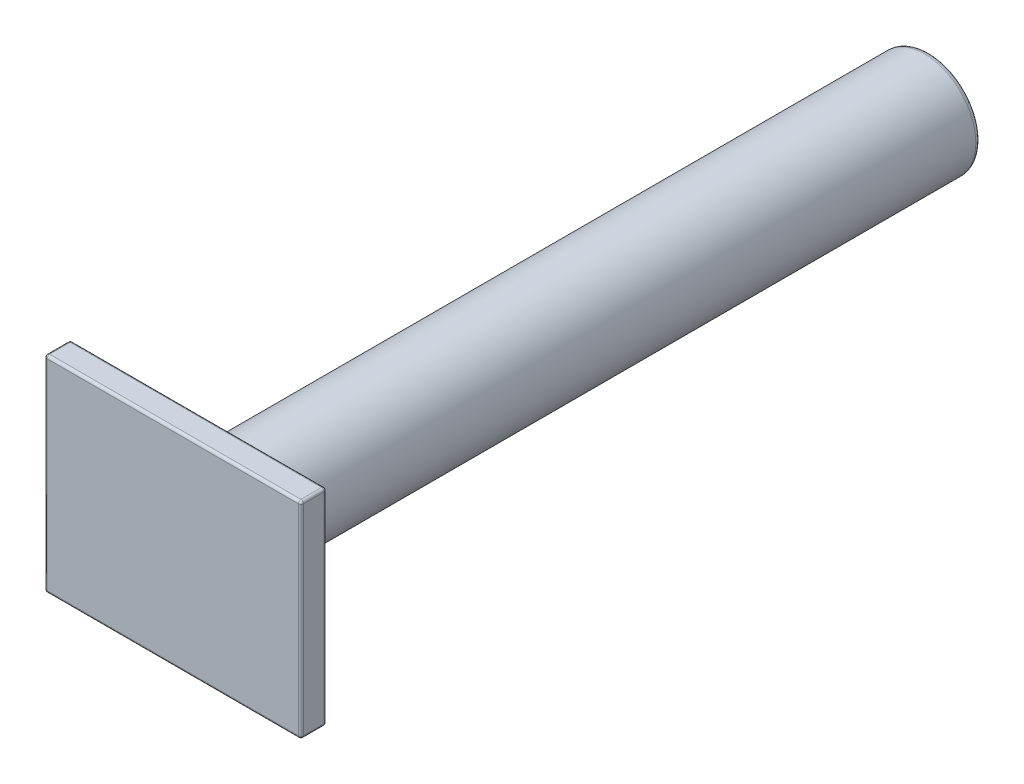
ISO-10303-21;
HEADER;
FILE_DESCRIPTION(('STEP AP214'),'2;1');
FILE_NAME('part.step','',(''),(''),'','','');
FILE_SCHEMA(('AUTOMOTIVE_DESIGN { 1 0 10303 214 1 1 1 1 }'));
ENDSEC;
DATA;
#1=APPLICATION_CONTEXT('core data for automotive mechanical design processes');
#2=APPLICATION_PROTOCOL_DEFINITION('international standard','automotive_design',2000,#1);
#3=PRODUCT_CONTEXT('',#1,'mechanical');
#4=PRODUCT('Part','Part','',(#3));
#5=PRODUCT_RELATED_PRODUCT_CATEGORY('part','',(#4));
#6=PRODUCT_DEFINITION_FORMATION('','',#4);
#7=PRODUCT_DEFINITION_CONTEXT('part definition',#1,'design');
#8=PRODUCT_DEFINITION('design','',#6,#7);
#9=PRODUCT_DEFINITION_SHAPE('','',#8);
#10=(LENGTH_UNIT() NAMED_UNIT(*) SI_UNIT(.MILLI.,.METRE.));
#11=(NAMED_UNIT(*) PLANE_ANGLE_UNIT() SI_UNIT($,.RADIAN.));
#12=(NAMED_UNIT(*) SI_UNIT($,.STERADIAN.) SOLID_ANGLE_UNIT());
#13=UNCERTAINTY_MEASURE_WITH_UNIT(LENGTH_MEASURE(1.E-05),#10,'distance_accuracy_value','');
#14=(GEOMETRIC_REPRESENTATION_CONTEXT(3) GLOBAL_UNCERTAINTY_ASSIGNED_CONTEXT((#13)) GLOBAL_UNIT_ASSIGNED_CONTEXT((#10,
#11,#12)) REPRESENTATION_CONTEXT('',''));
#15=CARTESIAN_POINT('',(0.,0.,0.));
#16=DIRECTION('',(0.,0.,1.));
#17=DIRECTION('',(1.,0.,0.));
#18=AXIS2_PLACEMENT_3D('',#15,#16,#17);
#19=CARTESIAN_POINT('',(0.,0.,284.));
#20=DIRECTION('',(0.,0.,-1.));
#21=DIRECTION('',(-1.,0.,0.));
#22=AXIS2_PLACEMENT_3D('',#19,#20,#21);
#23=CYLINDRICAL_SURFACE('',#22,20.);
#24=CARTESIAN_POINT('',(0.,0.,2.));
#25=DIRECTION('',(0.,0.,1.));
#26=DIRECTION('',(1.,0.,0.));
#27=AXIS2_PLACEMENT_3D('',#24,#25,#26);
#28=CIRCLE('',#27,20.);
#29=CARTESIAN_POINT('',(20.,0.,2.));
#30=VERTEX_POINT('',#29);
#31=EDGE_CURVE('E178',#30,#30,#28,.T.);
#32=ORIENTED_EDGE('',*,*,#31,.T.);
#33=EDGE_LOOP('',(#32));
#34=FACE_BOUND('',#33,.T.);
#35=CARTESIAN_POINT('',(0.,0.,284.));
#36=DIRECTION('',(0.,0.,1.));
#37=DIRECTION('',(1.,0.,0.));
#38=AXIS2_PLACEMENT_3D('',#35,#36,#37);
#39=CIRCLE('',#38,20.);
#40=CARTESIAN_POINT('',(20.,0.,284.));
#41=VERTEX_POINT('',#40);
#42=EDGE_CURVE('E316',#41,#41,#39,.T.);
#43=ORIENTED_EDGE('',*,*,#42,.F.);
#44=EDGE_LOOP('',(#43));
#45=FACE_BOUND('',#44,.T.);
#46=ADVANCED_FACE('F39',(#34,#45),#23,.T.);
#47=CARTESIAN_POINT('',(0.,0.,0.));
#48=DIRECTION('',(0.,0.,1.));
#49=DIRECTION('',(1.,0.,0.));
#50=AXIS2_PLACEMENT_3D('',#47,#48,#49);
#51=PLANE('',#50);
#52=CARTESIAN_POINT('',(0.,0.,0.));
#53=DIRECTION('',(0.,0.,1.));
#54=DIRECTION('',(1.,0.,0.));
#55=AXIS2_PLACEMENT_3D('',#52,#53,#54);
#56=CIRCLE('',#55,18.);
#57=CARTESIAN_POINT('',(18.,0.,0.));
#58=VERTEX_POINT('',#57);
#59=EDGE_CURVE('E174',#58,#58,#56,.F.);
#60=ORIENTED_EDGE('',*,*,#59,.T.);
#61=EDGE_LOOP('',(#60));
#62=FACE_BOUND('',#61,.T.);
#63=ADVANCED_FACE('F350',(#62),#51,.F.);
#64=CARTESIAN_POINT('',(49.8054474708182,40.,294.));
#65=DIRECTION('',(-1.,0.,0.));
#66=DIRECTION('',(0.,0.,1.));
#67=AXIS2_PLACEMENT_3D('',#64,#65,#66);
#68=PLANE('',#67);
#69=DIRECTION('',(0.,1.,0.));
#70=VECTOR('',#69,1.);
#71=CARTESIAN_POINT('',(49.8054474708182,40.,285.));
#72=LINE('',#71,#70);
#73=CARTESIAN_POINT('',(49.8054474708182,-39.,285.));
#74=VERTEX_POINT('',#73);
#75=CARTESIAN_POINT('',(49.8054474708182,39.,285.));
#76=VERTEX_POINT('',#75);
#77=EDGE_CURVE('E186',#74,#76,#72,.T.);
#78=ORIENTED_EDGE('',*,*,#77,.T.);
#79=DIRECTION('',(0.,0.,-1.));
#80=VECTOR('',#79,1.);
#81=CARTESIAN_POINT('',(49.8054474708182,39.,294.));
#82=LINE('',#81,#80);
#83=CARTESIAN_POINT('',(49.8054474708182,39.,293.));
#84=VERTEX_POINT('',#83);
#85=EDGE_CURVE('E195',#76,#84,#82,.F.);
#86=ORIENTED_EDGE('',*,*,#85,.T.);
#87=DIRECTION('',(0.,1.,0.));
#88=VECTOR('',#87,1.);
#89=CARTESIAN_POINT('',(49.8054474708182,-40.,293.));
#90=LINE('',#89,#88);
#91=CARTESIAN_POINT('',(49.8054474708182,-39.,293.));
#92=VERTEX_POINT('',#91);
#93=EDGE_CURVE('E192',#84,#92,#90,.F.);
#94=ORIENTED_EDGE('',*,*,#93,.T.);
#95=DIRECTION('',(0.,0.,-1.));
#96=VECTOR('',#95,1.);
#97=CARTESIAN_POINT('',(49.8054474708182,-39.,294.));
#98=LINE('',#97,#96);
#99=EDGE_CURVE('E189',#92,#74,#98,.T.);
#100=ORIENTED_EDGE('',*,*,#99,.T.);
#101=EDGE_LOOP('',(#78,#86,#94,#100));
#102=FACE_BOUND('',#101,.T.);
#103=ADVANCED_FACE('F354',(#102),#68,.F.);
#104=CARTESIAN_POINT('',(-49.8054474708183,40.,294.));
#105=DIRECTION('',(0.,-1.,0.));
#106=DIRECTION('',(1.,0.,0.));
#107=AXIS2_PLACEMENT_3D('',#104,#105,#106);
#108=PLANE('',#107);
#109=DIRECTION('',(0.,0.,-1.));
#110=VECTOR('',#109,1.);
#111=CARTESIAN_POINT('',(48.8054474708182,40.,294.));
#112=LINE('',#111,#110);
#113=CARTESIAN_POINT('',(48.8054474708182,40.,293.));
#114=VERTEX_POINT('',#113);
#115=CARTESIAN_POINT('',(48.8054474708182,40.,285.));
#116=VERTEX_POINT('',#115);
#117=EDGE_CURVE('E144',#114,#116,#112,.T.);
#118=ORIENTED_EDGE('',*,*,#117,.T.);
#119=DIRECTION('',(-1.,0.,0.));
#120=VECTOR('',#119,1.);
#121=CARTESIAN_POINT('',(-49.8054474708183,40.,285.));
#122=LINE('',#121,#120);
#123=CARTESIAN_POINT('',(-48.8054474708183,40.,285.));
#124=VERTEX_POINT('',#123);
#125=EDGE_CURVE('E139',#116,#124,#122,.T.);
#126=ORIENTED_EDGE('',*,*,#125,.T.);
#127=DIRECTION('',(0.,0.,-1.));
#128=VECTOR('',#127,1.);
#129=CARTESIAN_POINT('',(-48.8054474708183,40.,294.));
#130=LINE('',#129,#128);
#131=CARTESIAN_POINT('',(-48.8054474708183,40.,293.));
#132=VERTEX_POINT('',#131);
#133=EDGE_CURVE('E131',#124,#132,#130,.F.);
#134=ORIENTED_EDGE('',*,*,#133,.T.);
#135=DIRECTION('',(-1.,0.,0.));
#136=VECTOR('',#135,1.);
#137=CARTESIAN_POINT('',(49.8054474708182,40.,293.));
#138=LINE('',#137,#136);
#139=EDGE_CURVE('E136',#132,#114,#138,.F.);
#140=ORIENTED_EDGE('',*,*,#139,.T.);
#141=EDGE_LOOP('',(#118,#126,#134,#140));
#142=FACE_BOUND('',#141,.T.);
#143=ADVANCED_FACE('F134',(#142),#108,.F.);
#144=CARTESIAN_POINT('',(-49.8054474708183,40.,294.));
#145=DIRECTION('',(1.,0.,0.));
#146=DIRECTION('',(0.,1.,0.));
#147=AXIS2_PLACEMENT_3D('',#144,#145,#146);
#148=PLANE('',#147);
#149=DIRECTION('',(0.,-1.,0.));
#150=VECTOR('',#149,1.);
#151=CARTESIAN_POINT('',(-49.8054474708183,40.,293.));
#152=LINE('',#151,#150);
#153=CARTESIAN_POINT('',(-49.8054474708182,-39.,293.));
#154=VERTEX_POINT('',#153);
#155=CARTESIAN_POINT('',(-49.8054474708183,39.,293.));
#156=VERTEX_POINT('',#155);
#157=EDGE_CURVE('E205',#154,#156,#152,.F.);
#158=ORIENTED_EDGE('',*,*,#157,.T.);
#159=DIRECTION('',(0.,0.,-1.));
#160=VECTOR('',#159,1.);
#161=CARTESIAN_POINT('',(-49.8054474708183,39.,294.));
#162=LINE('',#161,#160);
#163=CARTESIAN_POINT('',(-49.8054474708183,39.,285.));
#164=VERTEX_POINT('',#163);
#165=EDGE_CURVE('E152',#156,#164,#162,.T.);
#166=ORIENTED_EDGE('',*,*,#165,.T.);
#167=DIRECTION('',(0.,-1.,0.));
#168=VECTOR('',#167,1.);
#169=CARTESIAN_POINT('',(-49.8054474708183,40.,285.));
#170=LINE('',#169,#168);
#171=CARTESIAN_POINT('',(-49.8054474708182,-39.,285.));
#172=VERTEX_POINT('',#171);
#173=EDGE_CURVE('E199',#164,#172,#170,.T.);
#174=ORIENTED_EDGE('',*,*,#173,.T.);
#175=DIRECTION('',(0.,0.,-1.));
#176=VECTOR('',#175,1.);
#177=CARTESIAN_POINT('',(-49.8054474708182,-39.,294.));
#178=LINE('',#177,#176);
#179=EDGE_CURVE('E202',#172,#154,#178,.F.);
#180=ORIENTED_EDGE('',*,*,#179,.T.);
#181=EDGE_LOOP('',(#158,#166,#174,#180));
#182=FACE_BOUND('',#181,.T.);
#183=ADVANCED_FACE('F363',(#182),#148,.F.);
#184=CARTESIAN_POINT('',(-49.8054474708182,-40.,294.));
#185=DIRECTION('',(0.,1.,0.));
#186=DIRECTION('',(-1.,0.,0.));
#187=AXIS2_PLACEMENT_3D('',#184,#185,#186);
#188=PLANE('',#187);
#189=DIRECTION('',(0.,0.,-1.));
#190=VECTOR('',#189,1.);
#191=CARTESIAN_POINT('',(48.8054474708182,-40.,294.));
#192=LINE('',#191,#190);
#193=CARTESIAN_POINT('',(48.8054474708182,-40.,285.));
#194=VERTEX_POINT('',#193);
#195=CARTESIAN_POINT('',(48.8054474708182,-40.,293.));
#196=VERTEX_POINT('',#195);
#197=EDGE_CURVE('E64',#194,#196,#192,.F.);
#198=ORIENTED_EDGE('',*,*,#197,.T.);
#199=DIRECTION('',(1.,0.,0.));
#200=VECTOR('',#199,1.);
#201=CARTESIAN_POINT('',(-49.8054474708182,-40.,293.));
#202=LINE('',#201,#200);
#203=CARTESIAN_POINT('',(-48.8054474708182,-40.,293.));
#204=VERTEX_POINT('',#203);
#205=EDGE_CURVE('E11',#196,#204,#202,.F.);
#206=ORIENTED_EDGE('',*,*,#205,.T.);
#207=DIRECTION('',(0.,0.,-1.));
#208=VECTOR('',#207,1.);
#209=CARTESIAN_POINT('',(-48.8054474708182,-40.,294.));
#210=LINE('',#209,#208);
#211=CARTESIAN_POINT('',(-48.8054474708182,-40.,285.));
#212=VERTEX_POINT('',#211);
#213=EDGE_CURVE('E49',#204,#212,#210,.T.);
#214=ORIENTED_EDGE('',*,*,#213,.T.);
#215=DIRECTION('',(1.,0.,0.));
#216=VECTOR('',#215,1.);
#217=CARTESIAN_POINT('',(-49.8054474708182,-40.,285.));
#218=LINE('',#217,#216);
#219=EDGE_CURVE('E236',#212,#194,#218,.T.);
#220=ORIENTED_EDGE('',*,*,#219,.T.);
#221=EDGE_LOOP('',(#198,#206,#214,#220));
#222=FACE_BOUND('',#221,.T.);
#223=ADVANCED_FACE('F366',(#222),#188,.F.);
#224=CARTESIAN_POINT('',(0.,0.,294.));
#225=DIRECTION('',(0.,0.,1.));
#226=DIRECTION('',(1.,0.,0.));
#227=AXIS2_PLACEMENT_3D('',#224,#225,#226);
#228=PLANE('',#227);
#229=DIRECTION('',(0.,-1.,0.));
#230=VECTOR('',#229,1.);
#231=CARTESIAN_POINT('',(-48.8054474708182,-40.,294.));
#232=LINE('',#231,#230);
#233=CARTESIAN_POINT('',(-48.8054474708183,39.,294.));
#234=VERTEX_POINT('',#233);
#235=CARTESIAN_POINT('',(-48.8054474708182,-39.,294.));
#236=VERTEX_POINT('',#235);
#237=EDGE_CURVE('E229',#234,#236,#232,.T.);
#238=ORIENTED_EDGE('',*,*,#237,.T.);
#239=DIRECTION('',(1.,0.,0.));
#240=VECTOR('',#239,1.);
#241=CARTESIAN_POINT('',(49.8054474708182,-39.,294.));
#242=LINE('',#241,#240);
#243=CARTESIAN_POINT('',(48.8054474708182,-39.,294.));
#244=VERTEX_POINT('',#243);
#245=EDGE_CURVE('E232',#236,#244,#242,.T.);
#246=ORIENTED_EDGE('',*,*,#245,.T.);
#247=DIRECTION('',(0.,1.,0.));
#248=VECTOR('',#247,1.);
#249=CARTESIAN_POINT('',(48.8054474708182,40.,294.));
#250=LINE('',#249,#248);
#251=CARTESIAN_POINT('',(48.8054474708182,39.,294.));
#252=VERTEX_POINT('',#251);
#253=EDGE_CURVE('E223',#244,#252,#250,.T.);
#254=ORIENTED_EDGE('',*,*,#253,.T.);
#255=DIRECTION('',(-1.,0.,0.));
#256=VECTOR('',#255,1.);
#257=CARTESIAN_POINT('',(-49.8054474708183,39.,294.));
#258=LINE('',#257,#256);
#259=EDGE_CURVE('E226',#252,#234,#258,.T.);
#260=ORIENTED_EDGE('',*,*,#259,.T.);
#261=EDGE_LOOP('',(#238,#246,#254,#260));
#262=FACE_BOUND('',#261,.T.);
#263=ADVANCED_FACE('F343',(#262),#228,.T.);
#264=CARTESIAN_POINT('',(0.,0.,284.));
#265=DIRECTION('',(0.,0.,1.));
#266=DIRECTION('',(1.,0.,0.));
#267=AXIS2_PLACEMENT_3D('',#264,#265,#266);
#268=PLANE('',#267);
#269=DIRECTION('',(-1.,0.,0.));
#270=VECTOR('',#269,1.);
#271=CARTESIAN_POINT('',(0.,39.,284.));
#272=LINE('',#271,#270);
#273=CARTESIAN_POINT('',(-48.8054474708183,39.,284.));
#274=VERTEX_POINT('',#273);
#275=CARTESIAN_POINT('',(48.8054474708182,39.,284.));
#276=VERTEX_POINT('',#275);
#277=EDGE_CURVE('E216',#274,#276,#272,.F.);
#278=ORIENTED_EDGE('',*,*,#277,.T.);
#279=DIRECTION('',(0.,1.,0.));
#280=VECTOR('',#279,1.);
#281=CARTESIAN_POINT('',(48.8054474708182,0.,284.));
#282=LINE('',#281,#280);
#283=CARTESIAN_POINT('',(48.8054474708182,-39.,284.));
#284=VERTEX_POINT('',#283);
#285=EDGE_CURVE('E220',#276,#284,#282,.F.);
#286=ORIENTED_EDGE('',*,*,#285,.T.);
#287=DIRECTION('',(1.,0.,0.));
#288=VECTOR('',#287,1.);
#289=CARTESIAN_POINT('',(0.,-39.,284.));
#290=LINE('',#289,#288);
#291=CARTESIAN_POINT('',(-48.8054474708182,-39.,284.));
#292=VERTEX_POINT('',#291);
#293=EDGE_CURVE('E213',#284,#292,#290,.F.);
#294=ORIENTED_EDGE('',*,*,#293,.T.);
#295=DIRECTION('',(0.,-1.,0.));
#296=VECTOR('',#295,1.);
#297=CARTESIAN_POINT('',(-48.8054474708182,0.,284.));
#298=LINE('',#297,#296);
#299=EDGE_CURVE('E210',#292,#274,#298,.F.);
#300=ORIENTED_EDGE('',*,*,#299,.T.);
#301=EDGE_LOOP('',(#278,#286,#294,#300));
#302=FACE_BOUND('',#301,.T.);
#303=ORIENTED_EDGE('',*,*,#42,.T.);
#304=EDGE_LOOP('',(#303));
#305=FACE_BOUND('',#304,.T.);
#306=ADVANCED_FACE('F334',(#302,#305),#268,.F.);
#307=CARTESIAN_POINT('',(0.,0.,2.));
#308=DIRECTION('',(0.,0.,1.));
#309=DIRECTION('',(1.,0.,0.));
#310=AXIS2_PLACEMENT_3D('',#307,#308,#309);
#311=TOROIDAL_SURFACE('',#310,18.,2.);
#312=ORIENTED_EDGE('',*,*,#59,.F.);
#313=EDGE_LOOP('',(#312));
#314=FACE_BOUND('',#313,.T.);
#315=ORIENTED_EDGE('',*,*,#31,.F.);
#316=EDGE_LOOP('',(#315));
#317=FACE_BOUND('',#316,.T.);
#318=ADVANCED_FACE('F332',(#314,#317),#311,.T.);
#319=CARTESIAN_POINT('',(-48.8054474708182,-39.,294.));
#320=DIRECTION('',(0.,0.,-1.));
#321=DIRECTION('',(-1.,0.,0.));
#322=AXIS2_PLACEMENT_3D('',#319,#320,#321);
#323=CYLINDRICAL_SURFACE('',#322,1.);
#324=CARTESIAN_POINT('',(-48.8054474708182,-39.,293.));
#325=DIRECTION('',(0.,0.,1.));
#326=DIRECTION('',(1.,0.,0.));
#327=AXIS2_PLACEMENT_3D('',#324,#325,#326);
#328=CIRCLE('',#327,1.);
#329=EDGE_CURVE('E43',#154,#204,#328,.T.);
#330=ORIENTED_EDGE('',*,*,#329,.F.);
#331=ORIENTED_EDGE('',*,*,#179,.F.);
#332=CARTESIAN_POINT('',(-48.8054474708182,-39.,285.));
#333=DIRECTION('',(0.,0.,-1.));
#334=DIRECTION('',(-1.,0.,0.));
#335=AXIS2_PLACEMENT_3D('',#332,#333,#334);
#336=CIRCLE('',#335,1.);
#337=EDGE_CURVE('E308',#212,#172,#336,.T.);
#338=ORIENTED_EDGE('',*,*,#337,.F.);
#339=ORIENTED_EDGE('',*,*,#213,.F.);
#340=EDGE_LOOP('',(#330,#331,#338,#339));
#341=FACE_BOUND('',#340,.T.);
#342=ADVANCED_FACE('F41',(#341),#323,.T.);
#343=CARTESIAN_POINT('',(-48.8054474708182,-39.,293.));
#344=DIRECTION('',(0.,0.,1.));
#345=DIRECTION('',(1.,0.,0.));
#346=AXIS2_PLACEMENT_3D('',#343,#344,#345);
#347=SPHERICAL_SURFACE('',#346,1.);
#348=CARTESIAN_POINT('',(-48.8054474708182,-39.,293.));
#349=DIRECTION('',(0.,-1.,0.));
#350=DIRECTION('',(0.,0.,-1.));
#351=AXIS2_PLACEMENT_3D('',#348,#349,#350);
#352=CIRCLE('',#351,1.);
#353=EDGE_CURVE('E303',#154,#236,#352,.F.);
#354=ORIENTED_EDGE('',*,*,#353,.F.);
#355=ORIENTED_EDGE('',*,*,#329,.T.);
#356=CARTESIAN_POINT('',(-48.8054474708182,-39.,293.));
#357=DIRECTION('',(-1.,0.,0.));
#358=DIRECTION('',(0.,0.,1.));
#359=AXIS2_PLACEMENT_3D('',#356,#357,#358);
#360=CIRCLE('',#359,1.);
#361=EDGE_CURVE('E57',#236,#204,#360,.F.);
#362=ORIENTED_EDGE('',*,*,#361,.F.);
#363=EDGE_LOOP('',(#354,#355,#362));
#364=FACE_BOUND('',#363,.T.);
#365=ADVANCED_FACE('F341',(#364),#347,.T.);
#366=CARTESIAN_POINT('',(-48.8054474708182,-39.,285.));
#367=DIRECTION('',(0.,0.,1.));
#368=DIRECTION('',(1.,0.,0.));
#369=AXIS2_PLACEMENT_3D('',#366,#367,#368);
#370=SPHERICAL_SURFACE('',#369,1.);
#371=CARTESIAN_POINT('',(-48.8054474708182,-39.,285.));
#372=DIRECTION('',(-1.,0.,0.));
#373=DIRECTION('',(0.,0.,1.));
#374=AXIS2_PLACEMENT_3D('',#371,#372,#373);
#375=CIRCLE('',#374,1.);
#376=EDGE_CURVE('E295',#212,#292,#375,.F.);
#377=ORIENTED_EDGE('',*,*,#376,.F.);
#378=ORIENTED_EDGE('',*,*,#337,.T.);
#379=CARTESIAN_POINT('',(-48.8054474708182,-39.,285.));
#380=DIRECTION('',(0.,-1.,0.));
#381=DIRECTION('',(0.,0.,-1.));
#382=AXIS2_PLACEMENT_3D('',#379,#380,#381);
#383=CIRCLE('',#382,1.);
#384=EDGE_CURVE('E299',#292,#172,#383,.F.);
#385=ORIENTED_EDGE('',*,*,#384,.F.);
#386=EDGE_LOOP('',(#377,#378,#385));
#387=FACE_BOUND('',#386,.T.);
#388=ADVANCED_FACE('F427',(#387),#370,.T.);
#389=CARTESIAN_POINT('',(0.,-39.,293.));
#390=DIRECTION('',(-1.,0.,0.));
#391=DIRECTION('',(0.,-1.,0.));
#392=AXIS2_PLACEMENT_3D('',#389,#390,#391);
#393=CYLINDRICAL_SURFACE('',#392,1.);
#394=ORIENTED_EDGE('',*,*,#361,.T.);
#395=ORIENTED_EDGE('',*,*,#205,.F.);
#396=CARTESIAN_POINT('',(48.8054474708182,-39.,293.));
#397=DIRECTION('',(1.,0.,0.));
#398=DIRECTION('',(0.,0.,-1.));
#399=AXIS2_PLACEMENT_3D('',#396,#397,#398);
#400=CIRCLE('',#399,1.);
#401=EDGE_CURVE('E287',#244,#196,#400,.T.);
#402=ORIENTED_EDGE('',*,*,#401,.F.);
#403=ORIENTED_EDGE('',*,*,#245,.F.);
#404=EDGE_LOOP('',(#394,#395,#402,#403));
#405=FACE_BOUND('',#404,.T.);
#406=ADVANCED_FACE('F379',(#405),#393,.T.);
#407=CARTESIAN_POINT('',(-48.8054474708182,0.,293.));
#408=DIRECTION('',(0.,1.,0.));
#409=DIRECTION('',(-1.,0.,0.));
#410=AXIS2_PLACEMENT_3D('',#407,#408,#409);
#411=CYLINDRICAL_SURFACE('',#410,1.);
#412=ORIENTED_EDGE('',*,*,#353,.T.);
#413=ORIENTED_EDGE('',*,*,#237,.F.);
#414=CARTESIAN_POINT('',(-48.8054474708183,39.,293.));
#415=DIRECTION('',(0.,1.,0.));
#416=DIRECTION('',(0.,0.,1.));
#417=AXIS2_PLACEMENT_3D('',#414,#415,#416);
#418=CIRCLE('',#417,1.);
#419=EDGE_CURVE('E157',#156,#234,#418,.T.);
#420=ORIENTED_EDGE('',*,*,#419,.F.);
#421=ORIENTED_EDGE('',*,*,#157,.F.);
#422=EDGE_LOOP('',(#412,#413,#420,#421));
#423=FACE_BOUND('',#422,.T.);
#424=ADVANCED_FACE('F377',(#423),#411,.T.);
#425=CARTESIAN_POINT('',(-48.8054474708183,39.,294.));
#426=DIRECTION('',(0.,0.,-1.));
#427=DIRECTION('',(-1.,0.,0.));
#428=AXIS2_PLACEMENT_3D('',#425,#426,#427);
#429=CYLINDRICAL_SURFACE('',#428,1.);
#430=CARTESIAN_POINT('',(-48.8054474708183,39.,285.));
#431=DIRECTION('',(0.,0.,-1.));
#432=DIRECTION('',(-1.,0.,0.));
#433=AXIS2_PLACEMENT_3D('',#430,#431,#432);
#434=CIRCLE('',#433,1.);
#435=EDGE_CURVE('E158',#164,#124,#434,.T.);
#436=ORIENTED_EDGE('',*,*,#435,.F.);
#437=ORIENTED_EDGE('',*,*,#165,.F.);
#438=CARTESIAN_POINT('',(-48.8054474708183,39.,293.));
#439=DIRECTION('',(0.,0.,1.));
#440=DIRECTION('',(1.,0.,0.));
#441=AXIS2_PLACEMENT_3D('',#438,#439,#440);
#442=CIRCLE('',#441,1.);
#443=EDGE_CURVE('E148',#132,#156,#442,.T.);
#444=ORIENTED_EDGE('',*,*,#443,.F.);
#445=ORIENTED_EDGE('',*,*,#133,.F.);
#446=EDGE_LOOP('',(#436,#437,#444,#445));
#447=FACE_BOUND('',#446,.T.);
#448=ADVANCED_FACE('F150',(#447),#429,.T.);
#449=CARTESIAN_POINT('',(-48.8054474708183,40.,285.));
#450=DIRECTION('',(0.,-1.,0.));
#451=DIRECTION('',(1.,0.,0.));
#452=AXIS2_PLACEMENT_3D('',#449,#450,#451);
#453=CYLINDRICAL_SURFACE('',#452,1.);
#454=ORIENTED_EDGE('',*,*,#384,.T.);
#455=ORIENTED_EDGE('',*,*,#173,.F.);
#456=CARTESIAN_POINT('',(-48.8054474708183,39.,285.));
#457=DIRECTION('',(0.,1.,0.));
#458=DIRECTION('',(0.,0.,1.));
#459=AXIS2_PLACEMENT_3D('',#456,#457,#458);
#460=CIRCLE('',#459,1.);
#461=EDGE_CURVE('E280',#274,#164,#460,.T.);
#462=ORIENTED_EDGE('',*,*,#461,.F.);
#463=ORIENTED_EDGE('',*,*,#299,.F.);
#464=EDGE_LOOP('',(#454,#455,#462,#463));
#465=FACE_BOUND('',#464,.T.);
#466=ADVANCED_FACE('F409',(#465),#453,.T.);
#467=CARTESIAN_POINT('',(-49.8054474708182,-39.,285.));
#468=DIRECTION('',(1.,0.,0.));
#469=DIRECTION('',(0.,1.,0.));
#470=AXIS2_PLACEMENT_3D('',#467,#468,#469);
#471=CYLINDRICAL_SURFACE('',#470,1.);
#472=ORIENTED_EDGE('',*,*,#376,.T.);
#473=ORIENTED_EDGE('',*,*,#293,.F.);
#474=CARTESIAN_POINT('',(48.8054474708182,-39.,285.));
#475=DIRECTION('',(1.,0.,0.));
#476=DIRECTION('',(0.,0.,-1.));
#477=AXIS2_PLACEMENT_3D('',#474,#475,#476);
#478=CIRCLE('',#477,1.);
#479=EDGE_CURVE('E276',#194,#284,#478,.T.);
#480=ORIENTED_EDGE('',*,*,#479,.F.);
#481=ORIENTED_EDGE('',*,*,#219,.F.);
#482=EDGE_LOOP('',(#472,#473,#480,#481));
#483=FACE_BOUND('',#482,.T.);
#484=ADVANCED_FACE('F421',(#483),#471,.T.);
#485=CARTESIAN_POINT('',(48.8054474708182,-39.,294.));
#486=DIRECTION('',(0.,0.,-1.));
#487=DIRECTION('',(-1.,0.,0.));
#488=AXIS2_PLACEMENT_3D('',#485,#486,#487);
#489=CYLINDRICAL_SURFACE('',#488,1.);
#490=CARTESIAN_POINT('',(48.8054474708182,-39.,293.));
#491=DIRECTION('',(0.,0.,1.));
#492=DIRECTION('',(1.,0.,0.));
#493=AXIS2_PLACEMENT_3D('',#490,#491,#492);
#494=CIRCLE('',#493,1.);
#495=EDGE_CURVE('E291',#196,#92,#494,.T.);
#496=ORIENTED_EDGE('',*,*,#495,.F.);
#497=ORIENTED_EDGE('',*,*,#197,.F.);
#498=CARTESIAN_POINT('',(48.8054474708182,-39.,285.));
#499=DIRECTION('',(0.,0.,-1.));
#500=DIRECTION('',(-1.,0.,0.));
#501=AXIS2_PLACEMENT_3D('',#498,#499,#500);
#502=CIRCLE('',#501,1.);
#503=EDGE_CURVE('E272',#74,#194,#502,.T.);
#504=ORIENTED_EDGE('',*,*,#503,.F.);
#505=ORIENTED_EDGE('',*,*,#99,.F.);
#506=EDGE_LOOP('',(#496,#497,#504,#505));
#507=FACE_BOUND('',#506,.T.);
#508=ADVANCED_FACE('F417',(#507),#489,.T.);
#509=CARTESIAN_POINT('',(48.8054474708182,-39.,293.));
#510=DIRECTION('',(0.,0.,1.));
#511=DIRECTION('',(1.,0.,0.));
#512=AXIS2_PLACEMENT_3D('',#509,#510,#511);
#513=SPHERICAL_SURFACE('',#512,1.);
#514=ORIENTED_EDGE('',*,*,#401,.T.);
#515=ORIENTED_EDGE('',*,*,#495,.T.);
#516=CARTESIAN_POINT('',(48.8054474708182,-39.,293.));
#517=DIRECTION('',(0.,-1.,0.));
#518=DIRECTION('',(0.,0.,-1.));
#519=AXIS2_PLACEMENT_3D('',#516,#517,#518);
#520=CIRCLE('',#519,1.);
#521=EDGE_CURVE('E166',#244,#92,#520,.F.);
#522=ORIENTED_EDGE('',*,*,#521,.F.);
#523=EDGE_LOOP('',(#514,#515,#522));
#524=FACE_BOUND('',#523,.T.);
#525=ADVANCED_FACE('F383',(#524),#513,.T.);
#526=CARTESIAN_POINT('',(-48.8054474708183,39.,293.));
#527=DIRECTION('',(0.,0.,1.));
#528=DIRECTION('',(1.,0.,0.));
#529=AXIS2_PLACEMENT_3D('',#526,#527,#528);
#530=SPHERICAL_SURFACE('',#529,1.);
#531=ORIENTED_EDGE('',*,*,#443,.T.);
#532=ORIENTED_EDGE('',*,*,#419,.T.);
#533=CARTESIAN_POINT('',(-48.8054474708183,39.,293.));
#534=DIRECTION('',(-1.,0.,0.));
#535=DIRECTION('',(0.,0.,1.));
#536=AXIS2_PLACEMENT_3D('',#533,#534,#535);
#537=CIRCLE('',#536,1.);
#538=EDGE_CURVE('E161',#132,#234,#537,.F.);
#539=ORIENTED_EDGE('',*,*,#538,.F.);
#540=EDGE_LOOP('',(#531,#532,#539));
#541=FACE_BOUND('',#540,.T.);
#542=ADVANCED_FACE('F162',(#541),#530,.T.);
#543=CARTESIAN_POINT('',(-48.8054474708183,39.,285.));
#544=DIRECTION('',(0.,0.,1.));
#545=DIRECTION('',(1.,0.,0.));
#546=AXIS2_PLACEMENT_3D('',#543,#544,#545);
#547=SPHERICAL_SURFACE('',#546,1.);
#548=ORIENTED_EDGE('',*,*,#461,.T.);
#549=ORIENTED_EDGE('',*,*,#435,.T.);
#550=CARTESIAN_POINT('',(-48.8054474708183,39.,285.));
#551=DIRECTION('',(-1.,0.,0.));
#552=DIRECTION('',(0.,0.,1.));
#553=AXIS2_PLACEMENT_3D('',#550,#551,#552);
#554=CIRCLE('',#553,1.);
#555=EDGE_CURVE('E167',#274,#124,#554,.F.);
#556=ORIENTED_EDGE('',*,*,#555,.F.);
#557=EDGE_LOOP('',(#548,#549,#556));
#558=FACE_BOUND('',#557,.T.);
#559=ADVANCED_FACE('F405',(#558),#547,.T.);
#560=CARTESIAN_POINT('',(48.8054474708182,-39.,285.));
#561=DIRECTION('',(0.,0.,1.));
#562=DIRECTION('',(1.,0.,0.));
#563=AXIS2_PLACEMENT_3D('',#560,#561,#562);
#564=SPHERICAL_SURFACE('',#563,1.);
#565=ORIENTED_EDGE('',*,*,#503,.T.);
#566=ORIENTED_EDGE('',*,*,#479,.T.);
#567=CARTESIAN_POINT('',(48.8054474708182,-39.,285.));
#568=DIRECTION('',(0.,-1.,0.));
#569=DIRECTION('',(0.,0.,-1.));
#570=AXIS2_PLACEMENT_3D('',#567,#568,#569);
#571=CIRCLE('',#570,1.);
#572=EDGE_CURVE('E262',#74,#284,#571,.F.);
#573=ORIENTED_EDGE('',*,*,#572,.F.);
#574=EDGE_LOOP('',(#565,#566,#573));
#575=FACE_BOUND('',#574,.T.);
#576=ADVANCED_FACE('F423',(#575),#564,.T.);
#577=CARTESIAN_POINT('',(48.8054474708182,0.,293.));
#578=DIRECTION('',(0.,-1.,0.));
#579=DIRECTION('',(0.,0.,-1.));
#580=AXIS2_PLACEMENT_3D('',#577,#578,#579);
#581=CYLINDRICAL_SURFACE('',#580,1.);
#582=ORIENTED_EDGE('',*,*,#521,.T.);
#583=ORIENTED_EDGE('',*,*,#93,.F.);
#584=CARTESIAN_POINT('',(48.8054474708182,39.,293.));
#585=DIRECTION('',(0.,1.,0.));
#586=DIRECTION('',(0.,0.,1.));
#587=AXIS2_PLACEMENT_3D('',#584,#585,#586);
#588=CIRCLE('',#587,1.);
#589=EDGE_CURVE('E258',#252,#84,#588,.T.);
#590=ORIENTED_EDGE('',*,*,#589,.F.);
#591=ORIENTED_EDGE('',*,*,#253,.F.);
#592=EDGE_LOOP('',(#582,#583,#590,#591));
#593=FACE_BOUND('',#592,.T.);
#594=ADVANCED_FACE('F386',(#593),#581,.T.);
#595=CARTESIAN_POINT('',(0.,39.,293.));
#596=DIRECTION('',(1.,0.,0.));
#597=DIRECTION('',(0.,1.,0.));
#598=AXIS2_PLACEMENT_3D('',#595,#596,#597);
#599=CYLINDRICAL_SURFACE('',#598,1.);
#600=ORIENTED_EDGE('',*,*,#538,.T.);
#601=ORIENTED_EDGE('',*,*,#259,.F.);
#602=CARTESIAN_POINT('',(48.8054474708182,39.,293.));
#603=DIRECTION('',(1.,0.,0.));
#604=DIRECTION('',(0.,0.,-1.));
#605=AXIS2_PLACEMENT_3D('',#602,#603,#604);
#606=CIRCLE('',#605,1.);
#607=EDGE_CURVE('E171',#114,#252,#606,.T.);
#608=ORIENTED_EDGE('',*,*,#607,.F.);
#609=ORIENTED_EDGE('',*,*,#139,.F.);
#610=EDGE_LOOP('',(#600,#601,#608,#609));
#611=FACE_BOUND('',#610,.T.);
#612=ADVANCED_FACE('F169',(#611),#599,.T.);
#613=CARTESIAN_POINT('',(-49.8054474708183,39.,285.));
#614=DIRECTION('',(-1.,0.,0.));
#615=DIRECTION('',(0.,-1.,0.));
#616=AXIS2_PLACEMENT_3D('',#613,#614,#615);
#617=CYLINDRICAL_SURFACE('',#616,1.);
#618=ORIENTED_EDGE('',*,*,#555,.T.);
#619=ORIENTED_EDGE('',*,*,#125,.F.);
#620=CARTESIAN_POINT('',(48.8054474708182,39.,285.));
#621=DIRECTION('',(1.,0.,0.));
#622=DIRECTION('',(0.,0.,-1.));
#623=AXIS2_PLACEMENT_3D('',#620,#621,#622);
#624=CIRCLE('',#623,1.);
#625=EDGE_CURVE('E252',#276,#116,#624,.T.);
#626=ORIENTED_EDGE('',*,*,#625,.F.);
#627=ORIENTED_EDGE('',*,*,#277,.F.);
#628=EDGE_LOOP('',(#618,#619,#626,#627));
#629=FACE_BOUND('',#628,.T.);
#630=ADVANCED_FACE('F402',(#629),#617,.T.);
#631=CARTESIAN_POINT('',(48.8054474708182,40.,285.));
#632=DIRECTION('',(0.,1.,0.));
#633=DIRECTION('',(0.,0.,1.));
#634=AXIS2_PLACEMENT_3D('',#631,#632,#633);
#635=CYLINDRICAL_SURFACE('',#634,1.);
#636=ORIENTED_EDGE('',*,*,#572,.T.);
#637=ORIENTED_EDGE('',*,*,#285,.F.);
#638=CARTESIAN_POINT('',(48.8054474708182,39.,285.));
#639=DIRECTION('',(0.,1.,0.));
#640=DIRECTION('',(0.,0.,1.));
#641=AXIS2_PLACEMENT_3D('',#638,#639,#640);
#642=CIRCLE('',#641,1.);
#643=EDGE_CURVE('E249',#76,#276,#642,.T.);
#644=ORIENTED_EDGE('',*,*,#643,.F.);
#645=ORIENTED_EDGE('',*,*,#77,.F.);
#646=EDGE_LOOP('',(#636,#637,#644,#645));
#647=FACE_BOUND('',#646,.T.);
#648=ADVANCED_FACE('F426',(#647),#635,.T.);
#649=CARTESIAN_POINT('',(48.8054474708182,39.,293.));
#650=DIRECTION('',(0.,0.,1.));
#651=DIRECTION('',(1.,0.,0.));
#652=AXIS2_PLACEMENT_3D('',#649,#650,#651);
#653=SPHERICAL_SURFACE('',#652,1.);
#654=ORIENTED_EDGE('',*,*,#607,.T.);
#655=ORIENTED_EDGE('',*,*,#589,.T.);
#656=CARTESIAN_POINT('',(48.8054474708182,39.,293.));
#657=DIRECTION('',(0.,0.,1.));
#658=DIRECTION('',(1.,0.,0.));
#659=AXIS2_PLACEMENT_3D('',#656,#657,#658);
#660=CIRCLE('',#659,1.);
#661=EDGE_CURVE('E246',#114,#84,#660,.F.);
#662=ORIENTED_EDGE('',*,*,#661,.F.);
#663=EDGE_LOOP('',(#654,#655,#662));
#664=FACE_BOUND('',#663,.T.);
#665=ADVANCED_FACE('F389',(#664),#653,.T.);
#666=CARTESIAN_POINT('',(48.8054474708182,39.,285.));
#667=DIRECTION('',(0.,0.,1.));
#668=DIRECTION('',(1.,0.,0.));
#669=AXIS2_PLACEMENT_3D('',#666,#667,#668);
#670=SPHERICAL_SURFACE('',#669,1.);
#671=ORIENTED_EDGE('',*,*,#643,.T.);
#672=ORIENTED_EDGE('',*,*,#625,.T.);
#673=CARTESIAN_POINT('',(48.8054474708182,39.,285.));
#674=DIRECTION('',(0.,0.,-1.));
#675=DIRECTION('',(-1.,0.,0.));
#676=AXIS2_PLACEMENT_3D('',#673,#674,#675);
#677=CIRCLE('',#676,1.);
#678=EDGE_CURVE('E243',#76,#116,#677,.F.);
#679=ORIENTED_EDGE('',*,*,#678,.F.);
#680=EDGE_LOOP('',(#671,#672,#679));
#681=FACE_BOUND('',#680,.T.);
#682=ADVANCED_FACE('F397',(#681),#670,.T.);
#683=CARTESIAN_POINT('',(48.8054474708182,39.,294.));
#684=DIRECTION('',(0.,0.,-1.));
#685=DIRECTION('',(-1.,0.,0.));
#686=AXIS2_PLACEMENT_3D('',#683,#684,#685);
#687=CYLINDRICAL_SURFACE('',#686,1.);
#688=ORIENTED_EDGE('',*,*,#661,.T.);
#689=ORIENTED_EDGE('',*,*,#85,.F.);
#690=ORIENTED_EDGE('',*,*,#678,.T.);
#691=ORIENTED_EDGE('',*,*,#117,.F.);
#692=EDGE_LOOP('',(#688,#689,#690,#691));
#693=FACE_BOUND('',#692,.T.);
#694=ADVANCED_FACE('F393',(#693),#687,.T.);
#695=CLOSED_SHELL('',(#46,#63,#103,#143,#183,#223,#263,#306,#318,#342,#365,#388,#406,#424,#448,
#466,#484,#508,#525,#542,#559,#576,#594,#612,#630,#648,#665,#682,#694));
#696=MANIFOLD_SOLID_BREP('B2',#695);
#697=ADVANCED_BREP_SHAPE_REPRESENTATION('',(#18,#696),#14);
#698=SHAPE_DEFINITION_REPRESENTATION(#9,#697);
ENDSEC;
END-ISO-10303-21;
